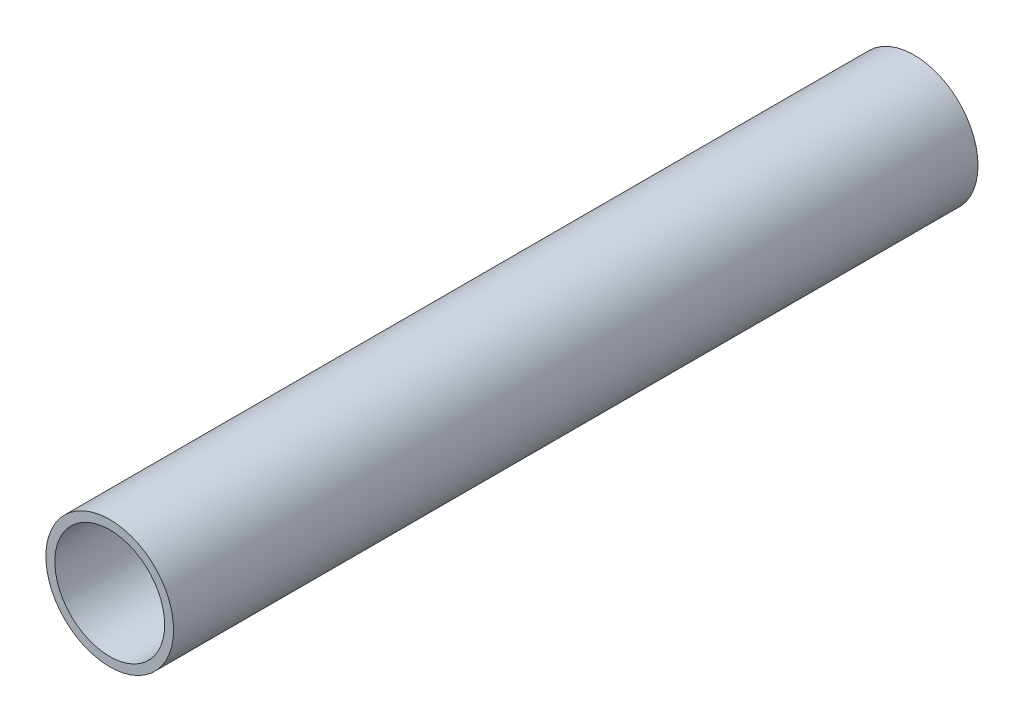
ISO-10303-21;
HEADER;
FILE_DESCRIPTION(('STEP AP214'),'2;1');
FILE_NAME('part.step','',(''),(''),'','','');
FILE_SCHEMA(('AUTOMOTIVE_DESIGN { 1 0 10303 214 1 1 1 1 }'));
ENDSEC;
DATA;
#1=APPLICATION_CONTEXT('core data for automotive mechanical design processes');
#2=APPLICATION_PROTOCOL_DEFINITION('international standard','automotive_design',2000,#1);
#3=PRODUCT_CONTEXT('',#1,'mechanical');
#4=PRODUCT('Part','Part','',(#3));
#5=PRODUCT_RELATED_PRODUCT_CATEGORY('part','',(#4));
#6=PRODUCT_DEFINITION_FORMATION('','',#4);
#7=PRODUCT_DEFINITION_CONTEXT('part definition',#1,'design');
#8=PRODUCT_DEFINITION('design','',#6,#7);
#9=PRODUCT_DEFINITION_SHAPE('','',#8);
#10=(LENGTH_UNIT() NAMED_UNIT(*) SI_UNIT(.MILLI.,.METRE.));
#11=(NAMED_UNIT(*) PLANE_ANGLE_UNIT() SI_UNIT($,.RADIAN.));
#12=(NAMED_UNIT(*) SI_UNIT($,.STERADIAN.) SOLID_ANGLE_UNIT());
#13=UNCERTAINTY_MEASURE_WITH_UNIT(LENGTH_MEASURE(1.E-05),#10,'distance_accuracy_value','');
#14=(GEOMETRIC_REPRESENTATION_CONTEXT(3) GLOBAL_UNCERTAINTY_ASSIGNED_CONTEXT((#13)) GLOBAL_UNIT_ASSIGNED_CONTEXT((#10,
#11,#12)) REPRESENTATION_CONTEXT('',''));
#15=CARTESIAN_POINT('',(0.,0.,0.));
#16=DIRECTION('',(0.,0.,1.));
#17=DIRECTION('',(1.,0.,0.));
#18=AXIS2_PLACEMENT_3D('',#15,#16,#17);
#19=CARTESIAN_POINT('',(0.,0.,80.));
#20=DIRECTION('',(0.,0.,1.));
#21=DIRECTION('',(1.,0.,0.));
#22=AXIS2_PLACEMENT_3D('',#19,#20,#21);
#23=PLANE('',#22);
#24=CARTESIAN_POINT('',(0.,0.,80.));
#25=DIRECTION('',(0.,0.,1.));
#26=DIRECTION('',(1.,0.,0.));
#27=AXIS2_PLACEMENT_3D('',#24,#25,#26);
#28=CIRCLE('',#27,6.35);
#29=CARTESIAN_POINT('',(6.35,0.,80.));
#30=VERTEX_POINT('',#29);
#31=EDGE_CURVE('E10',#30,#30,#28,.T.);
#32=ORIENTED_EDGE('',*,*,#31,.T.);
#33=EDGE_LOOP('',(#32));
#34=FACE_BOUND('',#33,.T.);
#35=CARTESIAN_POINT('',(0.,0.,80.));
#36=DIRECTION('',(0.,0.,1.));
#37=DIRECTION('',(1.,0.,0.));
#38=AXIS2_PLACEMENT_3D('',#35,#36,#37);
#39=CIRCLE('',#38,5.461);
#40=CARTESIAN_POINT('',(5.461,0.,80.));
#41=VERTEX_POINT('',#40);
#42=EDGE_CURVE('E42',#41,#41,#39,.T.);
#43=ORIENTED_EDGE('',*,*,#42,.F.);
#44=EDGE_LOOP('',(#43));
#45=FACE_BOUND('',#44,.T.);
#46=ADVANCED_FACE('F31',(#34,#45),#23,.T.);
#47=CARTESIAN_POINT('',(0.,0.,0.));
#48=DIRECTION('',(0.,0.,1.));
#49=DIRECTION('',(1.,0.,0.));
#50=AXIS2_PLACEMENT_3D('',#47,#48,#49);
#51=PLANE('',#50);
#52=CARTESIAN_POINT('',(0.,0.,0.));
#53=DIRECTION('',(0.,0.,1.));
#54=DIRECTION('',(1.,0.,0.));
#55=AXIS2_PLACEMENT_3D('',#52,#53,#54);
#56=CIRCLE('',#55,6.35);
#57=CARTESIAN_POINT('',(6.35,0.,0.));
#58=VERTEX_POINT('',#57);
#59=EDGE_CURVE('E35',#58,#58,#56,.T.);
#60=ORIENTED_EDGE('',*,*,#59,.F.);
#61=EDGE_LOOP('',(#60));
#62=FACE_BOUND('',#61,.T.);
#63=CARTESIAN_POINT('',(0.,0.,0.));
#64=DIRECTION('',(0.,0.,1.));
#65=DIRECTION('',(1.,0.,0.));
#66=AXIS2_PLACEMENT_3D('',#63,#64,#65);
#67=CIRCLE('',#66,5.461);
#68=CARTESIAN_POINT('',(5.461,0.,0.));
#69=VERTEX_POINT('',#68);
#70=EDGE_CURVE('E44',#69,#69,#67,.T.);
#71=ORIENTED_EDGE('',*,*,#70,.T.);
#72=EDGE_LOOP('',(#71));
#73=FACE_BOUND('',#72,.T.);
#74=ADVANCED_FACE('F54',(#62,#73),#51,.F.);
#75=CARTESIAN_POINT('',(0.,0.,80.));
#76=DIRECTION('',(0.,0.,-1.));
#77=DIRECTION('',(-1.,0.,0.));
#78=AXIS2_PLACEMENT_3D('',#75,#76,#77);
#79=CYLINDRICAL_SURFACE('',#78,6.35);
#80=ORIENTED_EDGE('',*,*,#31,.F.);
#81=EDGE_LOOP('',(#80));
#82=FACE_BOUND('',#81,.T.);
#83=ORIENTED_EDGE('',*,*,#59,.T.);
#84=EDGE_LOOP('',(#83));
#85=FACE_BOUND('',#84,.T.);
#86=ADVANCED_FACE('F33',(#82,#85),#79,.T.);
#87=CARTESIAN_POINT('',(0.,0.,80.));
#88=DIRECTION('',(0.,0.,-1.));
#89=DIRECTION('',(-1.,0.,0.));
#90=AXIS2_PLACEMENT_3D('',#87,#88,#89);
#91=CYLINDRICAL_SURFACE('',#90,5.461);
#92=ORIENTED_EDGE('',*,*,#42,.T.);
#93=EDGE_LOOP('',(#92));
#94=FACE_BOUND('',#93,.T.);
#95=ORIENTED_EDGE('',*,*,#70,.F.);
#96=EDGE_LOOP('',(#95));
#97=FACE_BOUND('',#96,.T.);
#98=ADVANCED_FACE('F50',(#94,#97),#91,.F.);
#99=CLOSED_SHELL('',(#46,#74,#86,#98));
#100=MANIFOLD_SOLID_BREP('B2',#99);
#101=ADVANCED_BREP_SHAPE_REPRESENTATION('',(#18,#100),#14);
#102=SHAPE_DEFINITION_REPRESENTATION(#9,#101);
ENDSEC;
END-ISO-10303-21;
